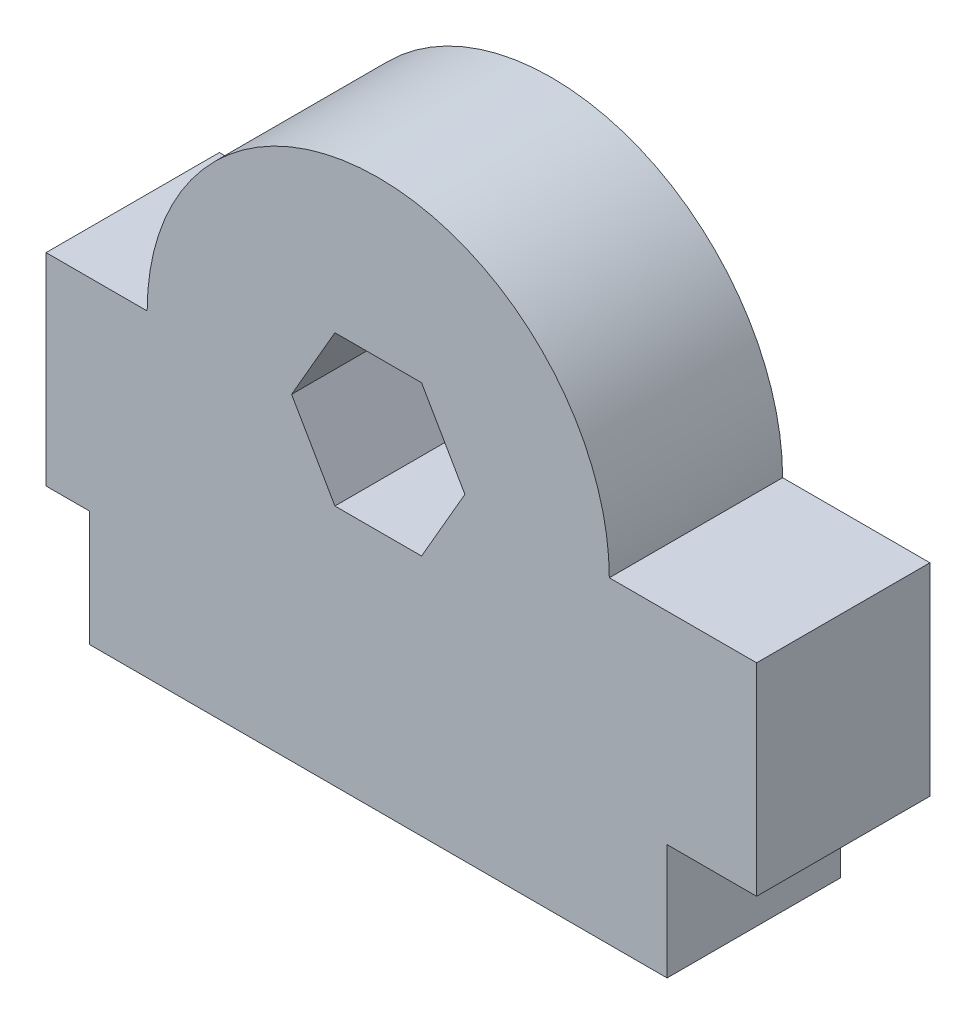
ISO-10303-21;
HEADER;
FILE_DESCRIPTION(('STEP AP214'),'2;1');
FILE_NAME('part.step','',(''),(''),'','','');
FILE_SCHEMA(('AUTOMOTIVE_DESIGN { 1 0 10303 214 1 1 1 1 }'));
ENDSEC;
DATA;
#1=APPLICATION_CONTEXT('core data for automotive mechanical design processes');
#2=APPLICATION_PROTOCOL_DEFINITION('international standard','automotive_design',2000,#1);
#3=PRODUCT_CONTEXT('',#1,'mechanical');
#4=PRODUCT('Part','Part','',(#3));
#5=PRODUCT_RELATED_PRODUCT_CATEGORY('part','',(#4));
#6=PRODUCT_DEFINITION_FORMATION('','',#4);
#7=PRODUCT_DEFINITION_CONTEXT('part definition',#1,'design');
#8=PRODUCT_DEFINITION('design','',#6,#7);
#9=PRODUCT_DEFINITION_SHAPE('','',#8);
#10=(LENGTH_UNIT() NAMED_UNIT(*) SI_UNIT(.MILLI.,.METRE.));
#11=(NAMED_UNIT(*) PLANE_ANGLE_UNIT() SI_UNIT($,.RADIAN.));
#12=(NAMED_UNIT(*) SI_UNIT($,.STERADIAN.) SOLID_ANGLE_UNIT());
#13=UNCERTAINTY_MEASURE_WITH_UNIT(LENGTH_MEASURE(1.E-05),#10,'distance_accuracy_value','');
#14=(GEOMETRIC_REPRESENTATION_CONTEXT(3) GLOBAL_UNCERTAINTY_ASSIGNED_CONTEXT((#13)) GLOBAL_UNIT_ASSIGNED_CONTEXT((#10,
#11,#12)) REPRESENTATION_CONTEXT('',''));
#15=CARTESIAN_POINT('',(0.,0.,0.));
#16=DIRECTION('',(0.,0.,1.));
#17=DIRECTION('',(1.,0.,0.));
#18=AXIS2_PLACEMENT_3D('',#15,#16,#17);
#19=CARTESIAN_POINT('',(10.,11.,6.));
#20=DIRECTION('',(0.,0.,1.));
#21=DIRECTION('',(1.,0.,0.));
#22=AXIS2_PLACEMENT_3D('',#19,#20,#21);
#23=PLANE('',#22);
#24=DIRECTION('',(0.,-1.,0.));
#25=VECTOR('',#24,1.);
#26=CARTESIAN_POINT('',(0.,0.,6.));
#27=LINE('',#26,#25);
#28=CARTESIAN_POINT('',(0.,4.,6.));
#29=VERTEX_POINT('',#28);
#30=CARTESIAN_POINT('',(0.,0.,6.));
#31=VERTEX_POINT('',#30);
#32=EDGE_CURVE('E196',#29,#31,#27,.T.);
#33=ORIENTED_EDGE('',*,*,#32,.T.);
#34=DIRECTION('',(1.,0.,0.));
#35=VECTOR('',#34,1.);
#36=CARTESIAN_POINT('',(0.,0.,6.));
#37=LINE('',#36,#35);
#38=CARTESIAN_POINT('',(20.,0.,6.));
#39=VERTEX_POINT('',#38);
#40=EDGE_CURVE('E199',#31,#39,#37,.T.);
#41=ORIENTED_EDGE('',*,*,#40,.T.);
#42=DIRECTION('',(0.,1.,0.));
#43=VECTOR('',#42,1.);
#44=CARTESIAN_POINT('',(20.,0.,6.));
#45=LINE('',#44,#43);
#46=CARTESIAN_POINT('',(20.,4.,6.));
#47=VERTEX_POINT('',#46);
#48=EDGE_CURVE('E202',#39,#47,#45,.T.);
#49=ORIENTED_EDGE('',*,*,#48,.T.);
#50=DIRECTION('',(1.,0.,0.));
#51=VECTOR('',#50,1.);
#52=CARTESIAN_POINT('',(23.1,4.,6.));
#53=LINE('',#52,#51);
#54=CARTESIAN_POINT('',(23.1,4.,6.));
#55=VERTEX_POINT('',#54);
#56=EDGE_CURVE('E204',#47,#55,#53,.T.);
#57=ORIENTED_EDGE('',*,*,#56,.T.);
#58=DIRECTION('',(0.,1.,0.));
#59=VECTOR('',#58,1.);
#60=CARTESIAN_POINT('',(23.1,11.,6.));
#61=LINE('',#60,#59);
#62=CARTESIAN_POINT('',(23.1,11.,6.));
#63=VERTEX_POINT('',#62);
#64=EDGE_CURVE('E206',#55,#63,#61,.T.);
#65=ORIENTED_EDGE('',*,*,#64,.T.);
#66=DIRECTION('',(-1.,0.,0.));
#67=VECTOR('',#66,1.);
#68=CARTESIAN_POINT('',(18.,11.,6.));
#69=LINE('',#68,#67);
#70=CARTESIAN_POINT('',(18.,11.,6.));
#71=VERTEX_POINT('',#70);
#72=EDGE_CURVE('E208',#63,#71,#69,.T.);
#73=ORIENTED_EDGE('',*,*,#72,.T.);
#74=CARTESIAN_POINT('',(10.,11.,6.));
#75=DIRECTION('',(0.,0.,1.));
#76=DIRECTION('',(1.,0.,0.));
#77=AXIS2_PLACEMENT_3D('',#74,#75,#76);
#78=CIRCLE('',#77,8.);
#79=CARTESIAN_POINT('',(2.,11.,6.));
#80=VERTEX_POINT('',#79);
#81=EDGE_CURVE('E210',#71,#80,#78,.T.);
#82=ORIENTED_EDGE('',*,*,#81,.T.);
#83=DIRECTION('',(-1.,0.,0.));
#84=VECTOR('',#83,1.);
#85=CARTESIAN_POINT('',(-1.5,11.,6.));
#86=LINE('',#85,#84);
#87=CARTESIAN_POINT('',(-1.5,11.,6.));
#88=VERTEX_POINT('',#87);
#89=EDGE_CURVE('E212',#80,#88,#86,.T.);
#90=ORIENTED_EDGE('',*,*,#89,.T.);
#91=DIRECTION('',(0.,-1.,0.));
#92=VECTOR('',#91,1.);
#93=CARTESIAN_POINT('',(-1.5,4.,6.));
#94=LINE('',#93,#92);
#95=CARTESIAN_POINT('',(-1.5,4.,6.));
#96=VERTEX_POINT('',#95);
#97=EDGE_CURVE('E214',#88,#96,#94,.T.);
#98=ORIENTED_EDGE('',*,*,#97,.T.);
#99=DIRECTION('',(1.,0.,0.));
#100=VECTOR('',#99,1.);
#101=CARTESIAN_POINT('',(0.,4.,6.));
#102=LINE('',#101,#100);
#103=EDGE_CURVE('E216',#96,#29,#102,.T.);
#104=ORIENTED_EDGE('',*,*,#103,.T.);
#105=EDGE_LOOP('',(#33,#41,#49,#57,#65,#73,#82,#90,#98,#104));
#106=FACE_BOUND('',#105,.T.);
#107=DIRECTION('',(-0.500000000000001,0.866025403784438,0.));
#108=VECTOR('',#107,1.);
#109=CARTESIAN_POINT('',(13.,11.,6.));
#110=LINE('',#109,#108);
#111=CARTESIAN_POINT('',(13.,11.,6.));
#112=VERTEX_POINT('',#111);
#113=CARTESIAN_POINT('',(11.5,13.5980762113533,6.));
#114=VERTEX_POINT('',#113);
#115=EDGE_CURVE('E153',#112,#114,#110,.T.);
#116=ORIENTED_EDGE('',*,*,#115,.F.);
#117=DIRECTION('',(0.499999999999995,0.866025403784441,0.));
#118=VECTOR('',#117,1.);
#119=CARTESIAN_POINT('',(11.5,8.4019237886467,6.));
#120=LINE('',#119,#118);
#121=CARTESIAN_POINT('',(11.5,8.4019237886467,6.));
#122=VERTEX_POINT('',#121);
#123=EDGE_CURVE('E145',#122,#112,#120,.T.);
#124=ORIENTED_EDGE('',*,*,#123,.F.);
#125=DIRECTION('',(1.,0.,0.));
#126=VECTOR('',#125,1.);
#127=CARTESIAN_POINT('',(8.50000000000002,8.40192378864667,6.));
#128=LINE('',#127,#126);
#129=CARTESIAN_POINT('',(8.50000000000002,8.40192378864667,6.));
#130=VERTEX_POINT('',#129);
#131=EDGE_CURVE('E174',#130,#122,#128,.T.);
#132=ORIENTED_EDGE('',*,*,#131,.F.);
#133=DIRECTION('',(0.500000000000007,-0.866025403784435,0.));
#134=VECTOR('',#133,1.);
#135=CARTESIAN_POINT('',(7.,11.,6.));
#136=LINE('',#135,#134);
#137=CARTESIAN_POINT('',(7.,11.,6.));
#138=VERTEX_POINT('',#137);
#139=EDGE_CURVE('E172',#138,#130,#136,.T.);
#140=ORIENTED_EDGE('',*,*,#139,.F.);
#141=DIRECTION('',(-0.499999999999995,-0.866025403784441,0.));
#142=VECTOR('',#141,1.);
#143=CARTESIAN_POINT('',(8.49999999999999,13.5980762113533,6.));
#144=LINE('',#143,#142);
#145=CARTESIAN_POINT('',(8.49999999999999,13.5980762113533,6.));
#146=VERTEX_POINT('',#145);
#147=EDGE_CURVE('E168',#146,#138,#144,.T.);
#148=ORIENTED_EDGE('',*,*,#147,.F.);
#149=DIRECTION('',(-1.,0.,0.));
#150=VECTOR('',#149,1.);
#151=CARTESIAN_POINT('',(11.5,13.5980762113533,6.));
#152=LINE('',#151,#150);
#153=EDGE_CURVE('E166',#114,#146,#152,.T.);
#154=ORIENTED_EDGE('',*,*,#153,.F.);
#155=EDGE_LOOP('',(#116,#124,#132,#140,#148,#154));
#156=FACE_BOUND('',#155,.T.);
#157=ADVANCED_FACE('F32',(#106,#156),#23,.T.);
#158=CARTESIAN_POINT('',(10.,11.,0.));
#159=DIRECTION('',(0.,0.,1.));
#160=DIRECTION('',(1.,0.,0.));
#161=AXIS2_PLACEMENT_3D('',#158,#159,#160);
#162=PLANE('',#161);
#163=DIRECTION('',(0.,-1.,0.));
#164=VECTOR('',#163,1.);
#165=CARTESIAN_POINT('',(0.,0.,0.));
#166=LINE('',#165,#164);
#167=CARTESIAN_POINT('',(0.,4.,0.));
#168=VERTEX_POINT('',#167);
#169=CARTESIAN_POINT('',(0.,0.,0.));
#170=VERTEX_POINT('',#169);
#171=EDGE_CURVE('E161',#168,#170,#166,.T.);
#172=ORIENTED_EDGE('',*,*,#171,.F.);
#173=DIRECTION('',(1.,0.,0.));
#174=VECTOR('',#173,1.);
#175=CARTESIAN_POINT('',(0.,4.,0.));
#176=LINE('',#175,#174);
#177=CARTESIAN_POINT('',(-1.5,4.,0.));
#178=VERTEX_POINT('',#177);
#179=EDGE_CURVE('E200',#178,#168,#176,.T.);
#180=ORIENTED_EDGE('',*,*,#179,.F.);
#181=DIRECTION('',(0.,-1.,0.));
#182=VECTOR('',#181,1.);
#183=CARTESIAN_POINT('',(-1.5,4.,0.));
#184=LINE('',#183,#182);
#185=CARTESIAN_POINT('',(-1.5,11.,0.));
#186=VERTEX_POINT('',#185);
#187=EDGE_CURVE('E235',#186,#178,#184,.T.);
#188=ORIENTED_EDGE('',*,*,#187,.F.);
#189=DIRECTION('',(-1.,0.,0.));
#190=VECTOR('',#189,1.);
#191=CARTESIAN_POINT('',(-1.5,11.,0.));
#192=LINE('',#191,#190);
#193=CARTESIAN_POINT('',(2.,11.,0.));
#194=VERTEX_POINT('',#193);
#195=EDGE_CURVE('E233',#194,#186,#192,.T.);
#196=ORIENTED_EDGE('',*,*,#195,.F.);
#197=CARTESIAN_POINT('',(10.,11.,0.));
#198=DIRECTION('',(0.,0.,1.));
#199=DIRECTION('',(1.,0.,0.));
#200=AXIS2_PLACEMENT_3D('',#197,#198,#199);
#201=CIRCLE('',#200,8.);
#202=CARTESIAN_POINT('',(18.,11.,0.));
#203=VERTEX_POINT('',#202);
#204=EDGE_CURVE('E231',#203,#194,#201,.T.);
#205=ORIENTED_EDGE('',*,*,#204,.F.);
#206=DIRECTION('',(-1.,0.,0.));
#207=VECTOR('',#206,1.);
#208=CARTESIAN_POINT('',(18.,11.,0.));
#209=LINE('',#208,#207);
#210=CARTESIAN_POINT('',(23.1,11.,0.));
#211=VERTEX_POINT('',#210);
#212=EDGE_CURVE('E229',#211,#203,#209,.T.);
#213=ORIENTED_EDGE('',*,*,#212,.F.);
#214=DIRECTION('',(0.,1.,0.));
#215=VECTOR('',#214,1.);
#216=CARTESIAN_POINT('',(23.1,11.,0.));
#217=LINE('',#216,#215);
#218=CARTESIAN_POINT('',(23.1,4.,0.));
#219=VERTEX_POINT('',#218);
#220=EDGE_CURVE('E227',#219,#211,#217,.T.);
#221=ORIENTED_EDGE('',*,*,#220,.F.);
#222=DIRECTION('',(1.,0.,0.));
#223=VECTOR('',#222,1.);
#224=CARTESIAN_POINT('',(23.1,4.,0.));
#225=LINE('',#224,#223);
#226=CARTESIAN_POINT('',(20.,4.,0.));
#227=VERTEX_POINT('',#226);
#228=EDGE_CURVE('E225',#227,#219,#225,.T.);
#229=ORIENTED_EDGE('',*,*,#228,.F.);
#230=DIRECTION('',(0.,1.,0.));
#231=VECTOR('',#230,1.);
#232=CARTESIAN_POINT('',(20.,0.,0.));
#233=LINE('',#232,#231);
#234=CARTESIAN_POINT('',(20.,0.,0.));
#235=VERTEX_POINT('',#234);
#236=EDGE_CURVE('E223',#235,#227,#233,.T.);
#237=ORIENTED_EDGE('',*,*,#236,.F.);
#238=DIRECTION('',(1.,0.,0.));
#239=VECTOR('',#238,1.);
#240=CARTESIAN_POINT('',(0.,0.,0.));
#241=LINE('',#240,#239);
#242=EDGE_CURVE('E221',#170,#235,#241,.T.);
#243=ORIENTED_EDGE('',*,*,#242,.F.);
#244=EDGE_LOOP('',(#172,#180,#188,#196,#205,#213,#221,#229,#237,#243));
#245=FACE_BOUND('',#244,.T.);
#246=DIRECTION('',(0.499999999999995,0.866025403784441,0.));
#247=VECTOR('',#246,1.);
#248=CARTESIAN_POINT('',(11.5,8.4019237886467,0.));
#249=LINE('',#248,#247);
#250=CARTESIAN_POINT('',(11.5,8.4019237886467,0.));
#251=VERTEX_POINT('',#250);
#252=CARTESIAN_POINT('',(13.,11.,0.));
#253=VERTEX_POINT('',#252);
#254=EDGE_CURVE('E55',#251,#253,#249,.T.);
#255=ORIENTED_EDGE('',*,*,#254,.T.);
#256=DIRECTION('',(-0.500000000000001,0.866025403784438,0.));
#257=VECTOR('',#256,1.);
#258=CARTESIAN_POINT('',(13.,11.,0.));
#259=LINE('',#258,#257);
#260=CARTESIAN_POINT('',(11.5,13.5980762113533,0.));
#261=VERTEX_POINT('',#260);
#262=EDGE_CURVE('E160',#253,#261,#259,.T.);
#263=ORIENTED_EDGE('',*,*,#262,.T.);
#264=DIRECTION('',(-1.,0.,0.));
#265=VECTOR('',#264,1.);
#266=CARTESIAN_POINT('',(11.5,13.5980762113533,0.));
#267=LINE('',#266,#265);
#268=CARTESIAN_POINT('',(8.49999999999999,13.5980762113533,0.));
#269=VERTEX_POINT('',#268);
#270=EDGE_CURVE('E178',#261,#269,#267,.T.);
#271=ORIENTED_EDGE('',*,*,#270,.T.);
#272=DIRECTION('',(-0.499999999999995,-0.866025403784441,0.));
#273=VECTOR('',#272,1.);
#274=CARTESIAN_POINT('',(8.49999999999999,13.5980762113533,0.));
#275=LINE('',#274,#273);
#276=CARTESIAN_POINT('',(7.,11.,0.));
#277=VERTEX_POINT('',#276);
#278=EDGE_CURVE('E181',#269,#277,#275,.T.);
#279=ORIENTED_EDGE('',*,*,#278,.T.);
#280=DIRECTION('',(0.500000000000007,-0.866025403784435,0.));
#281=VECTOR('',#280,1.);
#282=CARTESIAN_POINT('',(7.,11.,0.));
#283=LINE('',#282,#281);
#284=CARTESIAN_POINT('',(8.50000000000002,8.40192378864667,0.));
#285=VERTEX_POINT('',#284);
#286=EDGE_CURVE('E184',#277,#285,#283,.T.);
#287=ORIENTED_EDGE('',*,*,#286,.T.);
#288=DIRECTION('',(1.,0.,0.));
#289=VECTOR('',#288,1.);
#290=CARTESIAN_POINT('',(8.50000000000002,8.40192378864667,0.));
#291=LINE('',#290,#289);
#292=EDGE_CURVE('E154',#285,#251,#291,.T.);
#293=ORIENTED_EDGE('',*,*,#292,.T.);
#294=EDGE_LOOP('',(#255,#263,#271,#279,#287,#293));
#295=FACE_BOUND('',#294,.T.);
#296=ADVANCED_FACE('F271',(#245,#295),#162,.F.);
#297=CARTESIAN_POINT('',(0.,0.,6.));
#298=DIRECTION('',(1.,0.,0.));
#299=DIRECTION('',(0.,0.,-1.));
#300=AXIS2_PLACEMENT_3D('',#297,#298,#299);
#301=PLANE('',#300);
#302=ORIENTED_EDGE('',*,*,#171,.T.);
#303=DIRECTION('',(0.,0.,-1.));
#304=VECTOR('',#303,1.);
#305=CARTESIAN_POINT('',(0.,0.,6.));
#306=LINE('',#305,#304);
#307=EDGE_CURVE('E11',#31,#170,#306,.T.);
#308=ORIENTED_EDGE('',*,*,#307,.F.);
#309=ORIENTED_EDGE('',*,*,#32,.F.);
#310=DIRECTION('',(0.,0.,-1.));
#311=VECTOR('',#310,1.);
#312=CARTESIAN_POINT('',(0.,4.,6.));
#313=LINE('',#312,#311);
#314=EDGE_CURVE('E218',#29,#168,#313,.T.);
#315=ORIENTED_EDGE('',*,*,#314,.T.);
#316=EDGE_LOOP('',(#302,#308,#309,#315));
#317=FACE_BOUND('',#316,.T.);
#318=ADVANCED_FACE('F34',(#317),#301,.F.);
#319=CARTESIAN_POINT('',(0.,0.,6.));
#320=DIRECTION('',(0.,1.,0.));
#321=DIRECTION('',(0.,0.,1.));
#322=AXIS2_PLACEMENT_3D('',#319,#320,#321);
#323=PLANE('',#322);
#324=ORIENTED_EDGE('',*,*,#242,.T.);
#325=DIRECTION('',(0.,0.,-1.));
#326=VECTOR('',#325,1.);
#327=CARTESIAN_POINT('',(20.,0.,6.));
#328=LINE('',#327,#326);
#329=EDGE_CURVE('E40',#39,#235,#328,.T.);
#330=ORIENTED_EDGE('',*,*,#329,.F.);
#331=ORIENTED_EDGE('',*,*,#40,.F.);
#332=ORIENTED_EDGE('',*,*,#307,.T.);
#333=EDGE_LOOP('',(#324,#330,#331,#332));
#334=FACE_BOUND('',#333,.T.);
#335=ADVANCED_FACE('F288',(#334),#323,.F.);
#336=CARTESIAN_POINT('',(20.,0.,6.));
#337=DIRECTION('',(-1.,0.,0.));
#338=DIRECTION('',(0.,0.,1.));
#339=AXIS2_PLACEMENT_3D('',#336,#337,#338);
#340=PLANE('',#339);
#341=ORIENTED_EDGE('',*,*,#236,.T.);
#342=DIRECTION('',(0.,0.,-1.));
#343=VECTOR('',#342,1.);
#344=CARTESIAN_POINT('',(20.,4.,6.));
#345=LINE('',#344,#343);
#346=EDGE_CURVE('E258',#47,#227,#345,.T.);
#347=ORIENTED_EDGE('',*,*,#346,.F.);
#348=ORIENTED_EDGE('',*,*,#48,.F.);
#349=ORIENTED_EDGE('',*,*,#329,.T.);
#350=EDGE_LOOP('',(#341,#347,#348,#349));
#351=FACE_BOUND('',#350,.T.);
#352=ADVANCED_FACE('F265',(#351),#340,.F.);
#353=CARTESIAN_POINT('',(23.1,4.,6.));
#354=DIRECTION('',(0.,1.,0.));
#355=DIRECTION('',(-1.,0.,0.));
#356=AXIS2_PLACEMENT_3D('',#353,#354,#355);
#357=PLANE('',#356);
#358=ORIENTED_EDGE('',*,*,#228,.T.);
#359=DIRECTION('',(0.,0.,-1.));
#360=VECTOR('',#359,1.);
#361=CARTESIAN_POINT('',(23.1,4.,6.));
#362=LINE('',#361,#360);
#363=EDGE_CURVE('E255',#55,#219,#362,.T.);
#364=ORIENTED_EDGE('',*,*,#363,.F.);
#365=ORIENTED_EDGE('',*,*,#56,.F.);
#366=ORIENTED_EDGE('',*,*,#346,.T.);
#367=EDGE_LOOP('',(#358,#364,#365,#366));
#368=FACE_BOUND('',#367,.T.);
#369=ADVANCED_FACE('F277',(#368),#357,.F.);
#370=CARTESIAN_POINT('',(23.1,11.,6.));
#371=DIRECTION('',(-1.,0.,0.));
#372=DIRECTION('',(0.,0.,1.));
#373=AXIS2_PLACEMENT_3D('',#370,#371,#372);
#374=PLANE('',#373);
#375=ORIENTED_EDGE('',*,*,#220,.T.);
#376=DIRECTION('',(0.,0.,-1.));
#377=VECTOR('',#376,1.);
#378=CARTESIAN_POINT('',(23.1,11.,6.));
#379=LINE('',#378,#377);
#380=EDGE_CURVE('E252',#63,#211,#379,.T.);
#381=ORIENTED_EDGE('',*,*,#380,.F.);
#382=ORIENTED_EDGE('',*,*,#64,.F.);
#383=ORIENTED_EDGE('',*,*,#363,.T.);
#384=EDGE_LOOP('',(#375,#381,#382,#383));
#385=FACE_BOUND('',#384,.T.);
#386=ADVANCED_FACE('F281',(#385),#374,.F.);
#387=CARTESIAN_POINT('',(18.,11.,6.));
#388=DIRECTION('',(0.,-1.,0.));
#389=DIRECTION('',(1.,0.,0.));
#390=AXIS2_PLACEMENT_3D('',#387,#388,#389);
#391=PLANE('',#390);
#392=ORIENTED_EDGE('',*,*,#212,.T.);
#393=DIRECTION('',(0.,0.,-1.));
#394=VECTOR('',#393,1.);
#395=CARTESIAN_POINT('',(18.,11.,6.));
#396=LINE('',#395,#394);
#397=EDGE_CURVE('E249',#71,#203,#396,.T.);
#398=ORIENTED_EDGE('',*,*,#397,.F.);
#399=ORIENTED_EDGE('',*,*,#72,.F.);
#400=ORIENTED_EDGE('',*,*,#380,.T.);
#401=EDGE_LOOP('',(#392,#398,#399,#400));
#402=FACE_BOUND('',#401,.T.);
#403=ADVANCED_FACE('F311',(#402),#391,.F.);
#404=CARTESIAN_POINT('',(10.,11.,6.));
#405=DIRECTION('',(0.,0.,-1.));
#406=DIRECTION('',(-1.,0.,0.));
#407=AXIS2_PLACEMENT_3D('',#404,#405,#406);
#408=CYLINDRICAL_SURFACE('',#407,8.);
#409=ORIENTED_EDGE('',*,*,#204,.T.);
#410=DIRECTION('',(0.,0.,-1.));
#411=VECTOR('',#410,1.);
#412=CARTESIAN_POINT('',(2.,11.,6.));
#413=LINE('',#412,#411);
#414=EDGE_CURVE('E246',#80,#194,#413,.T.);
#415=ORIENTED_EDGE('',*,*,#414,.F.);
#416=ORIENTED_EDGE('',*,*,#81,.F.);
#417=ORIENTED_EDGE('',*,*,#397,.T.);
#418=EDGE_LOOP('',(#409,#415,#416,#417));
#419=FACE_BOUND('',#418,.T.);
#420=ADVANCED_FACE('F308',(#419),#408,.T.);
#421=CARTESIAN_POINT('',(-1.5,11.,6.));
#422=DIRECTION('',(0.,-1.,0.));
#423=DIRECTION('',(0.,0.,-1.));
#424=AXIS2_PLACEMENT_3D('',#421,#422,#423);
#425=PLANE('',#424);
#426=ORIENTED_EDGE('',*,*,#195,.T.);
#427=DIRECTION('',(0.,0.,-1.));
#428=VECTOR('',#427,1.);
#429=CARTESIAN_POINT('',(-1.5,11.,6.));
#430=LINE('',#429,#428);
#431=EDGE_CURVE('E243',#88,#186,#430,.T.);
#432=ORIENTED_EDGE('',*,*,#431,.F.);
#433=ORIENTED_EDGE('',*,*,#89,.F.);
#434=ORIENTED_EDGE('',*,*,#414,.T.);
#435=EDGE_LOOP('',(#426,#432,#433,#434));
#436=FACE_BOUND('',#435,.T.);
#437=ADVANCED_FACE('F304',(#436),#425,.F.);
#438=CARTESIAN_POINT('',(-1.5,4.,6.));
#439=DIRECTION('',(1.,0.,0.));
#440=DIRECTION('',(0.,0.,-1.));
#441=AXIS2_PLACEMENT_3D('',#438,#439,#440);
#442=PLANE('',#441);
#443=ORIENTED_EDGE('',*,*,#187,.T.);
#444=DIRECTION('',(0.,0.,-1.));
#445=VECTOR('',#444,1.);
#446=CARTESIAN_POINT('',(-1.5,4.,6.));
#447=LINE('',#446,#445);
#448=EDGE_CURVE('E240',#96,#178,#447,.T.);
#449=ORIENTED_EDGE('',*,*,#448,.F.);
#450=ORIENTED_EDGE('',*,*,#97,.F.);
#451=ORIENTED_EDGE('',*,*,#431,.T.);
#452=EDGE_LOOP('',(#443,#449,#450,#451));
#453=FACE_BOUND('',#452,.T.);
#454=ADVANCED_FACE('F300',(#453),#442,.F.);
#455=CARTESIAN_POINT('',(0.,4.,6.));
#456=DIRECTION('',(0.,1.,0.));
#457=DIRECTION('',(0.,0.,1.));
#458=AXIS2_PLACEMENT_3D('',#455,#456,#457);
#459=PLANE('',#458);
#460=ORIENTED_EDGE('',*,*,#179,.T.);
#461=ORIENTED_EDGE('',*,*,#314,.F.);
#462=ORIENTED_EDGE('',*,*,#103,.F.);
#463=ORIENTED_EDGE('',*,*,#448,.T.);
#464=EDGE_LOOP('',(#460,#461,#462,#463));
#465=FACE_BOUND('',#464,.T.);
#466=ADVANCED_FACE('F295',(#465),#459,.F.);
#467=CARTESIAN_POINT('',(11.5,8.4019237886467,6.));
#468=DIRECTION('',(-0.866025403784442,0.499999999999995,0.));
#469=DIRECTION('',(-0.499999999999995,-0.866025403784442,0.));
#470=AXIS2_PLACEMENT_3D('',#467,#468,#469);
#471=PLANE('',#470);
#472=ORIENTED_EDGE('',*,*,#254,.F.);
#473=DIRECTION('',(0.,0.,-1.));
#474=VECTOR('',#473,1.);
#475=CARTESIAN_POINT('',(11.5,8.4019237886467,6.));
#476=LINE('',#475,#474);
#477=EDGE_CURVE('E149',#122,#251,#476,.T.);
#478=ORIENTED_EDGE('',*,*,#477,.F.);
#479=ORIENTED_EDGE('',*,*,#123,.T.);
#480=DIRECTION('',(0.,0.,-1.));
#481=VECTOR('',#480,1.);
#482=CARTESIAN_POINT('',(13.,11.,6.));
#483=LINE('',#482,#481);
#484=EDGE_CURVE('E148',#112,#253,#483,.T.);
#485=ORIENTED_EDGE('',*,*,#484,.T.);
#486=EDGE_LOOP('',(#472,#478,#479,#485));
#487=FACE_BOUND('',#486,.T.);
#488=ADVANCED_FACE('F147',(#487),#471,.T.);
#489=CARTESIAN_POINT('',(13.,11.,6.));
#490=DIRECTION('',(-0.866025403784438,-0.500000000000001,0.));
#491=DIRECTION('',(0.500000000000001,-0.866025403784438,0.));
#492=AXIS2_PLACEMENT_3D('',#489,#490,#491);
#493=PLANE('',#492);
#494=ORIENTED_EDGE('',*,*,#262,.F.);
#495=ORIENTED_EDGE('',*,*,#484,.F.);
#496=ORIENTED_EDGE('',*,*,#115,.T.);
#497=DIRECTION('',(0.,0.,-1.));
#498=VECTOR('',#497,1.);
#499=CARTESIAN_POINT('',(11.5,13.5980762113533,6.));
#500=LINE('',#499,#498);
#501=EDGE_CURVE('E162',#114,#261,#500,.T.);
#502=ORIENTED_EDGE('',*,*,#501,.T.);
#503=EDGE_LOOP('',(#494,#495,#496,#502));
#504=FACE_BOUND('',#503,.T.);
#505=ADVANCED_FACE('F157',(#504),#493,.T.);
#506=CARTESIAN_POINT('',(11.5,13.5980762113533,6.));
#507=DIRECTION('',(0.,-1.,0.));
#508=DIRECTION('',(1.,0.,0.));
#509=AXIS2_PLACEMENT_3D('',#506,#507,#508);
#510=PLANE('',#509);
#511=ORIENTED_EDGE('',*,*,#270,.F.);
#512=ORIENTED_EDGE('',*,*,#501,.F.);
#513=ORIENTED_EDGE('',*,*,#153,.T.);
#514=DIRECTION('',(0.,0.,-1.));
#515=VECTOR('',#514,1.);
#516=CARTESIAN_POINT('',(8.49999999999999,13.5980762113533,6.));
#517=LINE('',#516,#515);
#518=EDGE_CURVE('E193',#146,#269,#517,.T.);
#519=ORIENTED_EDGE('',*,*,#518,.T.);
#520=EDGE_LOOP('',(#511,#512,#513,#519));
#521=FACE_BOUND('',#520,.T.);
#522=ADVANCED_FACE('F357',(#521),#510,.T.);
#523=CARTESIAN_POINT('',(8.49999999999999,13.5980762113533,6.));
#524=DIRECTION('',(0.866025403784441,-0.499999999999995,0.));
#525=DIRECTION('',(0.499999999999995,0.866025403784441,0.));
#526=AXIS2_PLACEMENT_3D('',#523,#524,#525);
#527=PLANE('',#526);
#528=ORIENTED_EDGE('',*,*,#278,.F.);
#529=ORIENTED_EDGE('',*,*,#518,.F.);
#530=ORIENTED_EDGE('',*,*,#147,.T.);
#531=DIRECTION('',(0.,0.,-1.));
#532=VECTOR('',#531,1.);
#533=CARTESIAN_POINT('',(7.,11.,6.));
#534=LINE('',#533,#532);
#535=EDGE_CURVE('E191',#138,#277,#534,.T.);
#536=ORIENTED_EDGE('',*,*,#535,.T.);
#537=EDGE_LOOP('',(#528,#529,#530,#536));
#538=FACE_BOUND('',#537,.T.);
#539=ADVANCED_FACE('F363',(#538),#527,.T.);
#540=CARTESIAN_POINT('',(7.,11.,6.));
#541=DIRECTION('',(0.866025403784435,0.500000000000007,0.));
#542=DIRECTION('',(-0.500000000000007,0.866025403784435,0.));
#543=AXIS2_PLACEMENT_3D('',#540,#541,#542);
#544=PLANE('',#543);
#545=ORIENTED_EDGE('',*,*,#286,.F.);
#546=ORIENTED_EDGE('',*,*,#535,.F.);
#547=ORIENTED_EDGE('',*,*,#139,.T.);
#548=DIRECTION('',(0.,0.,-1.));
#549=VECTOR('',#548,1.);
#550=CARTESIAN_POINT('',(8.50000000000002,8.40192378864667,6.));
#551=LINE('',#550,#549);
#552=EDGE_CURVE('E47',#130,#285,#551,.T.);
#553=ORIENTED_EDGE('',*,*,#552,.T.);
#554=EDGE_LOOP('',(#545,#546,#547,#553));
#555=FACE_BOUND('',#554,.T.);
#556=ADVANCED_FACE('F371',(#555),#544,.T.);
#557=CARTESIAN_POINT('',(8.50000000000002,8.40192378864667,6.));
#558=DIRECTION('',(0.,1.,0.));
#559=DIRECTION('',(-1.,0.,0.));
#560=AXIS2_PLACEMENT_3D('',#557,#558,#559);
#561=PLANE('',#560);
#562=ORIENTED_EDGE('',*,*,#292,.F.);
#563=ORIENTED_EDGE('',*,*,#552,.F.);
#564=ORIENTED_EDGE('',*,*,#131,.T.);
#565=ORIENTED_EDGE('',*,*,#477,.T.);
#566=EDGE_LOOP('',(#562,#563,#564,#565));
#567=FACE_BOUND('',#566,.T.);
#568=ADVANCED_FACE('F379',(#567),#561,.T.);
#569=CLOSED_SHELL('',(#157,#296,#318,#335,#352,#369,#386,#403,#420,#437,#454,#466,#488,#505,
#522,#539,#556,#568));
#570=MANIFOLD_SOLID_BREP('B2',#569);
#571=ADVANCED_BREP_SHAPE_REPRESENTATION('',(#18,#570),#14);
#572=SHAPE_DEFINITION_REPRESENTATION(#9,#571);
ENDSEC;
END-ISO-10303-21;
